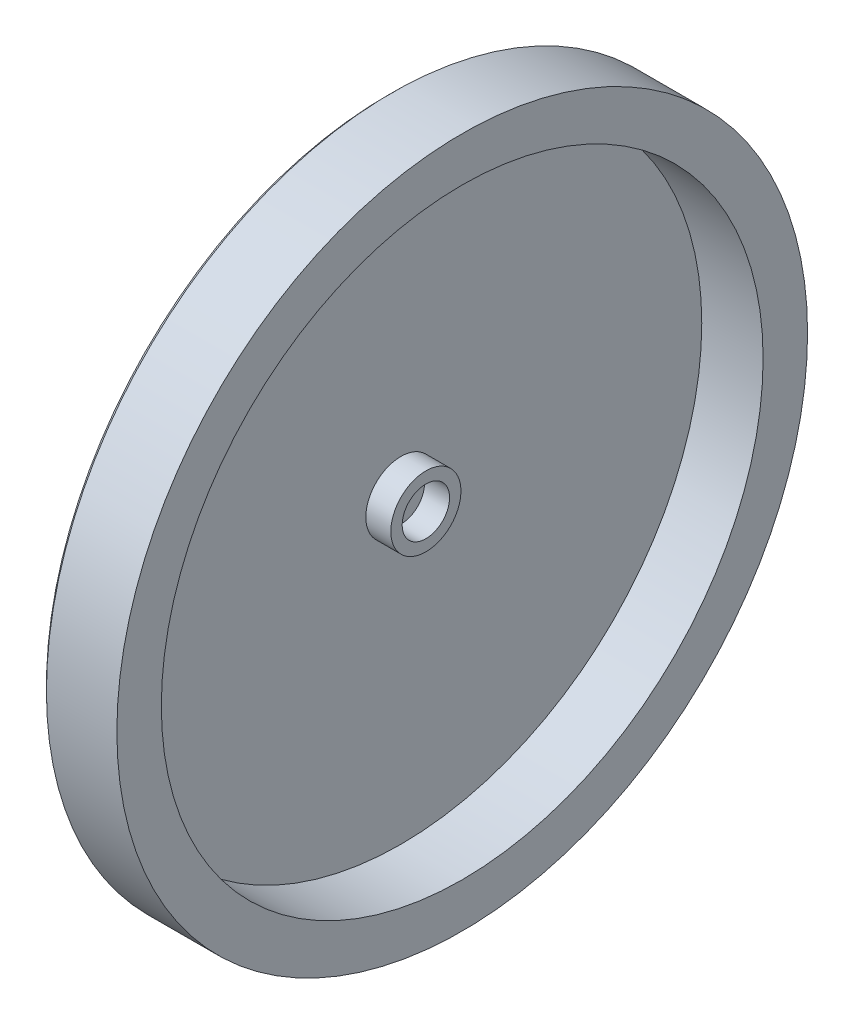
ISO-10303-21;
HEADER;
FILE_DESCRIPTION(('STEP AP214'),'2;1');
FILE_NAME('part.step','',(''),(''),'','','');
FILE_SCHEMA(('AUTOMOTIVE_DESIGN { 1 0 10303 214 1 1 1 1 }'));
ENDSEC;
DATA;
#1=APPLICATION_CONTEXT('core data for automotive mechanical design processes');
#2=APPLICATION_PROTOCOL_DEFINITION('international standard','automotive_design',2000,#1);
#3=PRODUCT_CONTEXT('',#1,'mechanical');
#4=PRODUCT('Part','Part','',(#3));
#5=PRODUCT_RELATED_PRODUCT_CATEGORY('part','',(#4));
#6=PRODUCT_DEFINITION_FORMATION('','',#4);
#7=PRODUCT_DEFINITION_CONTEXT('part definition',#1,'design');
#8=PRODUCT_DEFINITION('design','',#6,#7);
#9=PRODUCT_DEFINITION_SHAPE('','',#8);
#10=(LENGTH_UNIT() NAMED_UNIT(*) SI_UNIT(.MILLI.,.METRE.));
#11=(NAMED_UNIT(*) PLANE_ANGLE_UNIT() SI_UNIT($,.RADIAN.));
#12=(NAMED_UNIT(*) SI_UNIT($,.STERADIAN.) SOLID_ANGLE_UNIT());
#13=UNCERTAINTY_MEASURE_WITH_UNIT(LENGTH_MEASURE(1.E-05),#10,'distance_accuracy_value','');
#14=(GEOMETRIC_REPRESENTATION_CONTEXT(3) GLOBAL_UNCERTAINTY_ASSIGNED_CONTEXT((#13)) GLOBAL_UNIT_ASSIGNED_CONTEXT((#10,
#11,#12)) REPRESENTATION_CONTEXT('',''));
#15=CARTESIAN_POINT('',(0.,0.,0.));
#16=DIRECTION('',(0.,0.,1.));
#17=DIRECTION('',(1.,0.,0.));
#18=AXIS2_PLACEMENT_3D('',#15,#16,#17);
#19=CARTESIAN_POINT('',(537.225183996548,157.5,0.));
#20=DIRECTION('',(-1.,0.,0.));
#21=DIRECTION('',(0.,0.,1.));
#22=AXIS2_PLACEMENT_3D('',#19,#20,#21);
#23=CYLINDRICAL_SURFACE('',#22,15.432228314565);
#24=CARTESIAN_POINT('',(532.225183996548,157.5,0.));
#25=DIRECTION('',(-1.,0.,0.));
#26=DIRECTION('',(0.,0.,1.));
#27=AXIS2_PLACEMENT_3D('',#24,#25,#26);
#28=CIRCLE('',#27,15.432228314565);
#29=CARTESIAN_POINT('',(532.225183996548,157.5,15.432228314565));
#30=VERTEX_POINT('',#29);
#31=EDGE_CURVE('E18',#30,#30,#28,.F.);
#32=ORIENTED_EDGE('',*,*,#31,.T.);
#33=EDGE_LOOP('',(#32));
#34=FACE_BOUND('',#33,.T.);
#35=CARTESIAN_POINT('',(543.225183996548,157.5,0.));
#36=DIRECTION('',(-1.,0.,0.));
#37=DIRECTION('',(0.,0.,1.));
#38=AXIS2_PLACEMENT_3D('',#35,#36,#37);
#39=CIRCLE('',#38,15.432228314565);
#40=CARTESIAN_POINT('',(543.225183996548,157.5,15.432228314565));
#41=VERTEX_POINT('',#40);
#42=EDGE_CURVE('E48',#41,#41,#39,.T.);
#43=ORIENTED_EDGE('',*,*,#42,.T.);
#44=EDGE_LOOP('',(#43));
#45=FACE_BOUND('',#44,.T.);
#46=ADVANCED_FACE('F15',(#34,#45),#23,.T.);
#47=CARTESIAN_POINT('',(532.225183996548,251.432228314565,0.));
#48=DIRECTION('',(-1.,0.,0.));
#49=DIRECTION('',(0.,0.,1.));
#50=AXIS2_PLACEMENT_3D('',#47,#48,#49);
#51=PLANE('',#50);
#52=ORIENTED_EDGE('',*,*,#31,.F.);
#53=EDGE_LOOP('',(#52));
#54=FACE_BOUND('',#53,.T.);
#55=CARTESIAN_POINT('',(532.225183996548,157.5,0.));
#56=DIRECTION('',(-1.,0.,0.));
#57=DIRECTION('',(0.,0.,1.));
#58=AXIS2_PLACEMENT_3D('',#55,#56,#57);
#59=CIRCLE('',#58,132.432228314565);
#60=CARTESIAN_POINT('',(532.225183996548,157.5,132.432228314565));
#61=VERTEX_POINT('',#60);
#62=EDGE_CURVE('E46',#61,#61,#59,.F.);
#63=ORIENTED_EDGE('',*,*,#62,.T.);
#64=EDGE_LOOP('',(#63));
#65=FACE_BOUND('',#64,.T.);
#66=ADVANCED_FACE('F56',(#54,#65),#51,.F.);
#67=CARTESIAN_POINT('',(543.225183996548,170.432228314565,0.));
#68=DIRECTION('',(-1.,0.,0.));
#69=DIRECTION('',(0.,0.,1.));
#70=AXIS2_PLACEMENT_3D('',#67,#68,#69);
#71=PLANE('',#70);
#72=CARTESIAN_POINT('',(543.225183996548,157.5,0.));
#73=DIRECTION('',(-1.,0.,0.));
#74=DIRECTION('',(0.,0.,1.));
#75=AXIS2_PLACEMENT_3D('',#72,#73,#74);
#76=CIRCLE('',#75,10.432228314565);
#77=CARTESIAN_POINT('',(543.225183996548,157.5,10.432228314565));
#78=VERTEX_POINT('',#77);
#79=EDGE_CURVE('E43',#78,#78,#76,.T.);
#80=ORIENTED_EDGE('',*,*,#79,.T.);
#81=EDGE_LOOP('',(#80));
#82=FACE_BOUND('',#81,.T.);
#83=ORIENTED_EDGE('',*,*,#42,.F.);
#84=EDGE_LOOP('',(#83));
#85=FACE_BOUND('',#84,.T.);
#86=ADVANCED_FACE('F59',(#82,#85),#71,.F.);
#87=CARTESIAN_POINT('',(536.225183996548,157.5,0.));
#88=DIRECTION('',(-1.,0.,0.));
#89=DIRECTION('',(0.,0.,1.));
#90=AXIS2_PLACEMENT_3D('',#87,#88,#89);
#91=CYLINDRICAL_SURFACE('',#90,132.432228314565);
#92=ORIENTED_EDGE('',*,*,#62,.F.);
#93=EDGE_LOOP('',(#92));
#94=FACE_BOUND('',#93,.T.);
#95=CARTESIAN_POINT('',(559.225183996548,157.5,0.));
#96=DIRECTION('',(-1.,0.,0.));
#97=DIRECTION('',(0.,0.,1.));
#98=AXIS2_PLACEMENT_3D('',#95,#96,#97);
#99=CIRCLE('',#98,132.432228314565);
#100=CARTESIAN_POINT('',(559.225183996548,157.5,132.432228314565));
#101=VERTEX_POINT('',#100);
#102=EDGE_CURVE('E40',#101,#101,#99,.F.);
#103=ORIENTED_EDGE('',*,*,#102,.T.);
#104=EDGE_LOOP('',(#103));
#105=FACE_BOUND('',#104,.T.);
#106=ADVANCED_FACE('F62',(#94,#105),#91,.F.);
#107=CARTESIAN_POINT('',(535.725183996548,157.5,0.));
#108=DIRECTION('',(-1.,0.,0.));
#109=DIRECTION('',(0.,0.,1.));
#110=AXIS2_PLACEMENT_3D('',#107,#108,#109);
#111=CYLINDRICAL_SURFACE('',#110,10.432228314565);
#112=ORIENTED_EDGE('',*,*,#79,.F.);
#113=EDGE_LOOP('',(#112));
#114=FACE_BOUND('',#113,.T.);
#115=CARTESIAN_POINT('',(532.225183996548,157.5,0.));
#116=DIRECTION('',(-1.,0.,0.));
#117=DIRECTION('',(0.,0.,1.));
#118=AXIS2_PLACEMENT_3D('',#115,#116,#117);
#119=CIRCLE('',#118,10.432228314565);
#120=CARTESIAN_POINT('',(532.225183996548,157.5,10.432228314565));
#121=VERTEX_POINT('',#120);
#122=EDGE_CURVE('E37',#121,#121,#119,.T.);
#123=ORIENTED_EDGE('',*,*,#122,.T.);
#124=EDGE_LOOP('',(#123));
#125=FACE_BOUND('',#124,.T.);
#126=ADVANCED_FACE('F65',(#114,#125),#111,.F.);
#127=CARTESIAN_POINT('',(559.225183996548,301.432228314565,0.));
#128=DIRECTION('',(-1.,0.,0.));
#129=DIRECTION('',(0.,0.,1.));
#130=AXIS2_PLACEMENT_3D('',#127,#128,#129);
#131=PLANE('',#130);
#132=CARTESIAN_POINT('',(559.225183996548,157.5,0.));
#133=DIRECTION('',(-1.,0.,0.));
#134=DIRECTION('',(0.,0.,1.));
#135=AXIS2_PLACEMENT_3D('',#132,#133,#134);
#136=CIRCLE('',#135,152.);
#137=CARTESIAN_POINT('',(559.225183996548,157.5,152.));
#138=VERTEX_POINT('',#137);
#139=EDGE_CURVE('E34',#138,#138,#136,.T.);
#140=ORIENTED_EDGE('',*,*,#139,.F.);
#141=EDGE_LOOP('',(#140));
#142=FACE_BOUND('',#141,.T.);
#143=ORIENTED_EDGE('',*,*,#102,.F.);
#144=EDGE_LOOP('',(#143));
#145=FACE_BOUND('',#144,.T.);
#146=ADVANCED_FACE('F69',(#142,#145),#131,.F.);
#147=CARTESIAN_POINT('',(532.225183996548,251.432228314565,0.));
#148=DIRECTION('',(-1.,0.,0.));
#149=DIRECTION('',(0.,0.,1.));
#150=AXIS2_PLACEMENT_3D('',#147,#148,#149);
#151=PLANE('',#150);
#152=CARTESIAN_POINT('',(532.225183996548,157.5,0.));
#153=DIRECTION('',(-1.,0.,0.));
#154=DIRECTION('',(0.,0.,1.));
#155=AXIS2_PLACEMENT_3D('',#152,#153,#154);
#156=CIRCLE('',#155,3.43222831456501);
#157=CARTESIAN_POINT('',(532.225183996548,157.5,3.43222831456501));
#158=VERTEX_POINT('',#157);
#159=EDGE_CURVE('E31',#158,#158,#156,.T.);
#160=ORIENTED_EDGE('',*,*,#159,.T.);
#161=EDGE_LOOP('',(#160));
#162=FACE_BOUND('',#161,.T.);
#163=ORIENTED_EDGE('',*,*,#122,.F.);
#164=EDGE_LOOP('',(#163));
#165=FACE_BOUND('',#164,.T.);
#166=ADVANCED_FACE('F71',(#162,#165),#151,.F.);
#167=CARTESIAN_POINT('',(533.725183996548,157.5,0.));
#168=DIRECTION('',(-1.,0.,0.));
#169=DIRECTION('',(0.,0.,1.));
#170=AXIS2_PLACEMENT_3D('',#167,#168,#169);
#171=CYLINDRICAL_SURFACE('',#170,152.);
#172=CARTESIAN_POINT('',(528.225183996548,157.5,0.));
#173=DIRECTION('',(1.,0.,0.));
#174=DIRECTION('',(0.,-1.,0.));
#175=AXIS2_PLACEMENT_3D('',#172,#173,#174);
#176=CIRCLE('',#175,152.);
#177=CARTESIAN_POINT('',(528.225183996548,5.50000000000001,0.));
#178=VERTEX_POINT('',#177);
#179=EDGE_CURVE('E27',#178,#178,#176,.F.);
#180=ORIENTED_EDGE('',*,*,#179,.F.);
#181=EDGE_LOOP('',(#180));
#182=FACE_BOUND('',#181,.T.);
#183=ORIENTED_EDGE('',*,*,#139,.T.);
#184=EDGE_LOOP('',(#183));
#185=FACE_BOUND('',#184,.T.);
#186=ADVANCED_FACE('F79',(#182,#185),#171,.T.);
#187=CARTESIAN_POINT('',(529.225183996548,157.5,0.));
#188=DIRECTION('',(-1.,0.,0.));
#189=DIRECTION('',(0.,0.,1.));
#190=AXIS2_PLACEMENT_3D('',#187,#188,#189);
#191=CYLINDRICAL_SURFACE('',#190,3.43222831456501);
#192=CARTESIAN_POINT('',(526.225183996548,157.5,0.));
#193=DIRECTION('',(-1.,0.,0.));
#194=DIRECTION('',(0.,0.,1.));
#195=AXIS2_PLACEMENT_3D('',#192,#193,#194);
#196=CIRCLE('',#195,3.43222831456501);
#197=CARTESIAN_POINT('',(526.225183996548,157.5,3.43222831456501));
#198=VERTEX_POINT('',#197);
#199=EDGE_CURVE('E22',#198,#198,#196,.F.);
#200=ORIENTED_EDGE('',*,*,#199,.F.);
#201=EDGE_LOOP('',(#200));
#202=FACE_BOUND('',#201,.T.);
#203=ORIENTED_EDGE('',*,*,#159,.F.);
#204=EDGE_LOOP('',(#203));
#205=FACE_BOUND('',#204,.T.);
#206=ADVANCED_FACE('F92',(#202,#205),#191,.F.);
#207=CARTESIAN_POINT('',(528.225183996548,157.5,0.));
#208=DIRECTION('',(1.,0.,0.));
#209=DIRECTION('',(0.,0.,-1.));
#210=AXIS2_PLACEMENT_3D('',#207,#208,#209);
#211=CONICAL_SURFACE('',#210,152.,0.785398163397448);
#212=ORIENTED_EDGE('',*,*,#179,.T.);
#213=EDGE_LOOP('',(#212));
#214=FACE_BOUND('',#213,.T.);
#215=CARTESIAN_POINT('',(526.225183996548,157.5,0.));
#216=DIRECTION('',(1.,0.,0.));
#217=DIRECTION('',(0.,0.,-1.));
#218=AXIS2_PLACEMENT_3D('',#215,#216,#217);
#219=CIRCLE('',#218,150.);
#220=CARTESIAN_POINT('',(526.225183996548,157.5,-150.));
#221=VERTEX_POINT('',#220);
#222=EDGE_CURVE('E10',#221,#221,#219,.F.);
#223=ORIENTED_EDGE('',*,*,#222,.F.);
#224=EDGE_LOOP('',(#223));
#225=FACE_BOUND('',#224,.T.);
#226=ADVANCED_FACE('F87',(#214,#225),#211,.T.);
#227=CARTESIAN_POINT('',(526.225183996548,234.932228314565,0.));
#228=DIRECTION('',(-1.,0.,0.));
#229=DIRECTION('',(0.,0.,1.));
#230=AXIS2_PLACEMENT_3D('',#227,#228,#229);
#231=PLANE('',#230);
#232=ORIENTED_EDGE('',*,*,#222,.T.);
#233=EDGE_LOOP('',(#232));
#234=FACE_BOUND('',#233,.T.);
#235=ORIENTED_EDGE('',*,*,#199,.T.);
#236=EDGE_LOOP('',(#235));
#237=FACE_BOUND('',#236,.T.);
#238=ADVANCED_FACE('F85',(#234,#237),#231,.T.);
#239=CLOSED_SHELL('',(#46,#66,#86,#106,#126,#146,#166,#186,#206,#226,#238));
#240=MANIFOLD_SOLID_BREP('B1',#239);
#241=ADVANCED_BREP_SHAPE_REPRESENTATION('',(#18,#240),#14);
#242=SHAPE_DEFINITION_REPRESENTATION(#9,#241);
ENDSEC;
END-ISO-10303-21;
